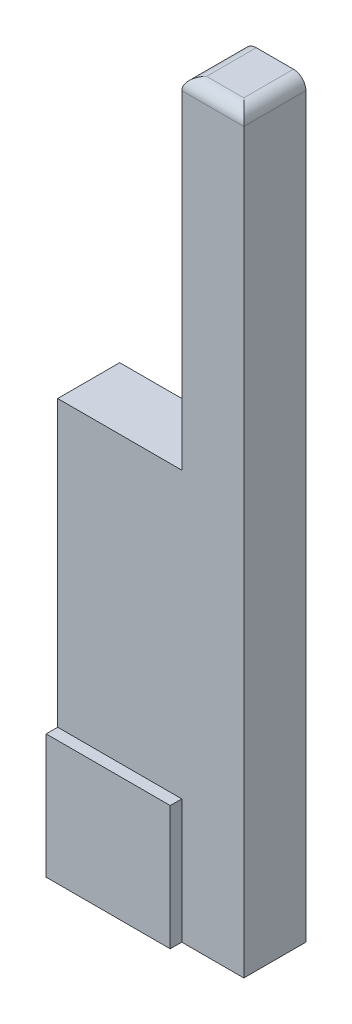
ISO-10303-21;
HEADER;
FILE_DESCRIPTION(('STEP AP214'),'2;1');
FILE_NAME('part.step','',(''),(''),'','','');
FILE_SCHEMA(('AUTOMOTIVE_DESIGN { 1 0 10303 214 1 1 1 1 }'));
ENDSEC;
DATA;
#1=APPLICATION_CONTEXT('core data for automotive mechanical design processes');
#2=APPLICATION_PROTOCOL_DEFINITION('international standard','automotive_design',2000,#1);
#3=PRODUCT_CONTEXT('',#1,'mechanical');
#4=PRODUCT('Part','Part','',(#3));
#5=PRODUCT_RELATED_PRODUCT_CATEGORY('part','',(#4));
#6=PRODUCT_DEFINITION_FORMATION('','',#4);
#7=PRODUCT_DEFINITION_CONTEXT('part definition',#1,'design');
#8=PRODUCT_DEFINITION('design','',#6,#7);
#9=PRODUCT_DEFINITION_SHAPE('','',#8);
#10=(LENGTH_UNIT() NAMED_UNIT(*) SI_UNIT(.MILLI.,.METRE.));
#11=(NAMED_UNIT(*) PLANE_ANGLE_UNIT() SI_UNIT($,.RADIAN.));
#12=(NAMED_UNIT(*) SI_UNIT($,.STERADIAN.) SOLID_ANGLE_UNIT());
#13=UNCERTAINTY_MEASURE_WITH_UNIT(LENGTH_MEASURE(1.E-05),#10,'distance_accuracy_value','');
#14=(GEOMETRIC_REPRESENTATION_CONTEXT(3) GLOBAL_UNCERTAINTY_ASSIGNED_CONTEXT((#13)) GLOBAL_UNIT_ASSIGNED_CONTEXT((#10,
#11,#12)) REPRESENTATION_CONTEXT('',''));
#15=CARTESIAN_POINT('',(0.,0.,0.));
#16=DIRECTION('',(0.,0.,1.));
#17=DIRECTION('',(1.,0.,0.));
#18=AXIS2_PLACEMENT_3D('',#15,#16,#17);
#19=CARTESIAN_POINT('',(10.,-15.48,5.));
#20=DIRECTION('',(0.,-1.,0.));
#21=DIRECTION('',(0.,0.,-1.));
#22=AXIS2_PLACEMENT_3D('',#19,#20,#21);
#23=PLANE('',#22);
#24=DIRECTION('',(-1.,0.,0.));
#25=VECTOR('',#24,1.);
#26=CARTESIAN_POINT('',(10.,-15.48,0.));
#27=LINE('',#26,#25);
#28=CARTESIAN_POINT('',(10.,-15.48,0.));
#29=VERTEX_POINT('',#28);
#30=CARTESIAN_POINT('',(0.,-15.48,0.));
#31=VERTEX_POINT('',#30);
#32=EDGE_CURVE('E159',#29,#31,#27,.T.);
#33=ORIENTED_EDGE('',*,*,#32,.T.);
#34=DIRECTION('',(0.,0.,-1.));
#35=VECTOR('',#34,1.);
#36=CARTESIAN_POINT('',(0.,-15.48,5.));
#37=LINE('',#36,#35);
#38=CARTESIAN_POINT('',(0.,-15.48,5.));
#39=VERTEX_POINT('',#38);
#40=EDGE_CURVE('E191',#39,#31,#37,.T.);
#41=ORIENTED_EDGE('',*,*,#40,.F.);
#42=DIRECTION('',(-1.,0.,0.));
#43=VECTOR('',#42,1.);
#44=CARTESIAN_POINT('',(10.,-15.48,5.));
#45=LINE('',#44,#43);
#46=CARTESIAN_POINT('',(10.,-15.48,5.));
#47=VERTEX_POINT('',#46);
#48=EDGE_CURVE('E160',#47,#39,#45,.T.);
#49=ORIENTED_EDGE('',*,*,#48,.F.);
#50=DIRECTION('',(0.,0.,-1.));
#51=VECTOR('',#50,1.);
#52=CARTESIAN_POINT('',(10.,-15.48,5.));
#53=LINE('',#52,#51);
#54=EDGE_CURVE('E172',#47,#29,#53,.T.);
#55=ORIENTED_EDGE('',*,*,#54,.T.);
#56=EDGE_LOOP('',(#33,#41,#49,#55));
#57=FACE_BOUND('',#56,.T.);
#58=ADVANCED_FACE('F32',(#57),#23,.F.);
#59=CARTESIAN_POINT('',(0.,-15.48,5.));
#60=DIRECTION('',(1.,0.,0.));
#61=DIRECTION('',(0.,1.,0.));
#62=AXIS2_PLACEMENT_3D('',#59,#60,#61);
#63=PLANE('',#62);
#64=DIRECTION('',(0.,-1.,0.));
#65=VECTOR('',#64,1.);
#66=CARTESIAN_POINT('',(0.,-15.48,0.));
#67=LINE('',#66,#65);
#68=CARTESIAN_POINT('',(0.,-48.42,0.));
#69=VERTEX_POINT('',#68);
#70=EDGE_CURVE('E175',#31,#69,#67,.T.);
#71=ORIENTED_EDGE('',*,*,#70,.T.);
#72=DIRECTION('',(0.,0.,-1.));
#73=VECTOR('',#72,1.);
#74=CARTESIAN_POINT('',(0.,-48.42,5.));
#75=LINE('',#74,#73);
#76=CARTESIAN_POINT('',(0.,-48.42,5.93));
#77=VERTEX_POINT('',#76);
#78=EDGE_CURVE('E141',#77,#69,#75,.T.);
#79=ORIENTED_EDGE('',*,*,#78,.F.);
#80=DIRECTION('',(0.,1.,0.));
#81=VECTOR('',#80,1.);
#82=CARTESIAN_POINT('',(0.,-38.42,5.93));
#83=LINE('',#82,#81);
#84=CARTESIAN_POINT('',(0.,-38.42,5.93));
#85=VERTEX_POINT('',#84);
#86=EDGE_CURVE('E134',#77,#85,#83,.T.);
#87=ORIENTED_EDGE('',*,*,#86,.T.);
#88=DIRECTION('',(0.,0.,-1.));
#89=VECTOR('',#88,1.);
#90=CARTESIAN_POINT('',(0.,-38.42,5.93));
#91=LINE('',#90,#89);
#92=CARTESIAN_POINT('',(0.,-38.42,5.));
#93=VERTEX_POINT('',#92);
#94=EDGE_CURVE('E118',#85,#93,#91,.T.);
#95=ORIENTED_EDGE('',*,*,#94,.T.);
#96=DIRECTION('',(0.,-1.,0.));
#97=VECTOR('',#96,1.);
#98=CARTESIAN_POINT('',(0.,-15.48,5.));
#99=LINE('',#98,#97);
#100=EDGE_CURVE('E163',#39,#93,#99,.T.);
#101=ORIENTED_EDGE('',*,*,#100,.F.);
#102=ORIENTED_EDGE('',*,*,#40,.T.);
#103=EDGE_LOOP('',(#71,#79,#87,#95,#101,#102));
#104=FACE_BOUND('',#103,.T.);
#105=ADVANCED_FACE('F139',(#104),#63,.F.);
#106=CARTESIAN_POINT('',(0.,-48.42,5.));
#107=DIRECTION('',(0.,1.,0.));
#108=DIRECTION('',(0.,0.,1.));
#109=AXIS2_PLACEMENT_3D('',#106,#107,#108);
#110=PLANE('',#109);
#111=CARTESIAN_POINT('',(12.5,-48.42,2.5));
#112=DIRECTION('',(0.,-1.,0.));
#113=DIRECTION('',(0.,0.,-1.));
#114=AXIS2_PLACEMENT_3D('',#111,#112,#113);
#115=CIRCLE('',#114,1.02939652566357);
#116=CARTESIAN_POINT('',(12.5,-48.42,1.47060347433643));
#117=VERTEX_POINT('',#116);
#118=EDGE_CURVE('E146',#117,#117,#115,.T.);
#119=ORIENTED_EDGE('',*,*,#118,.F.);
#120=EDGE_LOOP('',(#119));
#121=FACE_BOUND('',#120,.T.);
#122=DIRECTION('',(1.,0.,0.));
#123=VECTOR('',#122,1.);
#124=CARTESIAN_POINT('',(0.,-48.42,5.));
#125=LINE('',#124,#123);
#126=CARTESIAN_POINT('',(10.,-48.42,5.));
#127=VERTEX_POINT('',#126);
#128=CARTESIAN_POINT('',(15.,-48.42,5.));
#129=VERTEX_POINT('',#128);
#130=EDGE_CURVE('E166',#127,#129,#125,.T.);
#131=ORIENTED_EDGE('',*,*,#130,.F.);
#132=DIRECTION('',(0.,0.,-1.));
#133=VECTOR('',#132,1.);
#134=CARTESIAN_POINT('',(10.,-48.42,5.93));
#135=LINE('',#134,#133);
#136=CARTESIAN_POINT('',(10.,-48.42,5.93));
#137=VERTEX_POINT('',#136);
#138=EDGE_CURVE('E151',#137,#127,#135,.T.);
#139=ORIENTED_EDGE('',*,*,#138,.F.);
#140=DIRECTION('',(-1.,0.,0.));
#141=VECTOR('',#140,1.);
#142=CARTESIAN_POINT('',(0.,-48.42,5.93));
#143=LINE('',#142,#141);
#144=EDGE_CURVE('E127',#137,#77,#143,.T.);
#145=ORIENTED_EDGE('',*,*,#144,.T.);
#146=ORIENTED_EDGE('',*,*,#78,.T.);
#147=DIRECTION('',(1.,0.,0.));
#148=VECTOR('',#147,1.);
#149=CARTESIAN_POINT('',(0.,-48.42,0.));
#150=LINE('',#149,#148);
#151=CARTESIAN_POINT('',(15.,-48.42,0.));
#152=VERTEX_POINT('',#151);
#153=EDGE_CURVE('E177',#69,#152,#150,.T.);
#154=ORIENTED_EDGE('',*,*,#153,.T.);
#155=DIRECTION('',(0.,0.,-1.));
#156=VECTOR('',#155,1.);
#157=CARTESIAN_POINT('',(15.,-48.42,5.));
#158=LINE('',#157,#156);
#159=EDGE_CURVE('E187',#129,#152,#158,.T.);
#160=ORIENTED_EDGE('',*,*,#159,.F.);
#161=EDGE_LOOP('',(#131,#139,#145,#146,#154,#160));
#162=FACE_BOUND('',#161,.T.);
#163=ADVANCED_FACE('F220',(#121,#162),#110,.F.);
#164=CARTESIAN_POINT('',(15.,-48.42,5.));
#165=DIRECTION('',(-1.,0.,0.));
#166=DIRECTION('',(0.,-1.,0.));
#167=AXIS2_PLACEMENT_3D('',#164,#165,#166);
#168=PLANE('',#167);
#169=DIRECTION('',(0.,1.,0.));
#170=VECTOR('',#169,1.);
#171=CARTESIAN_POINT('',(15.,-48.42,0.));
#172=LINE('',#171,#170);
#173=CARTESIAN_POINT('',(15.,11.,0.));
#174=VERTEX_POINT('',#173);
#175=EDGE_CURVE('E179',#152,#174,#172,.T.);
#176=ORIENTED_EDGE('',*,*,#175,.T.);
#177=DIRECTION('',(0.,0.,-1.));
#178=VECTOR('',#177,1.);
#179=CARTESIAN_POINT('',(15.,11.,5.));
#180=LINE('',#179,#178);
#181=CARTESIAN_POINT('',(15.,11.,5.));
#182=VERTEX_POINT('',#181);
#183=EDGE_CURVE('E41',#174,#182,#180,.F.);
#184=ORIENTED_EDGE('',*,*,#183,.T.);
#185=DIRECTION('',(0.,1.,0.));
#186=VECTOR('',#185,1.);
#187=CARTESIAN_POINT('',(15.,-48.42,5.));
#188=LINE('',#187,#186);
#189=EDGE_CURVE('E168',#129,#182,#188,.T.);
#190=ORIENTED_EDGE('',*,*,#189,.F.);
#191=ORIENTED_EDGE('',*,*,#159,.T.);
#192=EDGE_LOOP('',(#176,#184,#190,#191));
#193=FACE_BOUND('',#192,.T.);
#194=ADVANCED_FACE('F223',(#193),#168,.F.);
#195=CARTESIAN_POINT('',(15.,12.,5.));
#196=DIRECTION('',(0.,-1.,0.));
#197=DIRECTION('',(0.,0.,-1.));
#198=AXIS2_PLACEMENT_3D('',#195,#196,#197);
#199=PLANE('',#198);
#200=DIRECTION('',(-1.,0.,0.));
#201=VECTOR('',#200,1.);
#202=CARTESIAN_POINT('',(15.,12.,0.));
#203=LINE('',#202,#201);
#204=CARTESIAN_POINT('',(14.,12.,0.));
#205=VERTEX_POINT('',#204);
#206=CARTESIAN_POINT('',(11.,12.,0.));
#207=VERTEX_POINT('',#206);
#208=EDGE_CURVE('E181',#205,#207,#203,.T.);
#209=ORIENTED_EDGE('',*,*,#208,.T.);
#210=DIRECTION('',(0.,0.,-1.));
#211=VECTOR('',#210,1.);
#212=CARTESIAN_POINT('',(11.,12.,5.));
#213=LINE('',#212,#211);
#214=CARTESIAN_POINT('',(11.,12.,4.));
#215=VERTEX_POINT('',#214);
#216=EDGE_CURVE('E204',#207,#215,#213,.F.);
#217=ORIENTED_EDGE('',*,*,#216,.T.);
#218=DIRECTION('',(-1.,0.,0.));
#219=VECTOR('',#218,1.);
#220=CARTESIAN_POINT('',(15.,12.,4.));
#221=LINE('',#220,#219);
#222=CARTESIAN_POINT('',(14.,12.,4.));
#223=VERTEX_POINT('',#222);
#224=EDGE_CURVE('E56',#215,#223,#221,.F.);
#225=ORIENTED_EDGE('',*,*,#224,.T.);
#226=DIRECTION('',(0.,0.,-1.));
#227=VECTOR('',#226,1.);
#228=CARTESIAN_POINT('',(14.,12.,5.));
#229=LINE('',#228,#227);
#230=EDGE_CURVE('E202',#223,#205,#229,.T.);
#231=ORIENTED_EDGE('',*,*,#230,.T.);
#232=EDGE_LOOP('',(#209,#217,#225,#231));
#233=FACE_BOUND('',#232,.T.);
#234=ADVANCED_FACE('F251',(#233),#199,.F.);
#235=CARTESIAN_POINT('',(10.,12.,5.));
#236=DIRECTION('',(1.,0.,0.));
#237=DIRECTION('',(0.,1.,0.));
#238=AXIS2_PLACEMENT_3D('',#235,#236,#237);
#239=PLANE('',#238);
#240=DIRECTION('',(0.,-1.,0.));
#241=VECTOR('',#240,1.);
#242=CARTESIAN_POINT('',(10.,12.,5.));
#243=LINE('',#242,#241);
#244=CARTESIAN_POINT('',(10.,11.,5.));
#245=VERTEX_POINT('',#244);
#246=EDGE_CURVE('E170',#245,#47,#243,.T.);
#247=ORIENTED_EDGE('',*,*,#246,.F.);
#248=DIRECTION('',(0.,0.,-1.));
#249=VECTOR('',#248,1.);
#250=CARTESIAN_POINT('',(10.,11.,5.));
#251=LINE('',#250,#249);
#252=CARTESIAN_POINT('',(10.,11.,0.));
#253=VERTEX_POINT('',#252);
#254=EDGE_CURVE('E194',#245,#253,#251,.T.);
#255=ORIENTED_EDGE('',*,*,#254,.T.);
#256=DIRECTION('',(0.,-1.,0.));
#257=VECTOR('',#256,1.);
#258=CARTESIAN_POINT('',(10.,12.,0.));
#259=LINE('',#258,#257);
#260=EDGE_CURVE('E164',#253,#29,#259,.T.);
#261=ORIENTED_EDGE('',*,*,#260,.T.);
#262=ORIENTED_EDGE('',*,*,#54,.F.);
#263=EDGE_LOOP('',(#247,#255,#261,#262));
#264=FACE_BOUND('',#263,.T.);
#265=ADVANCED_FACE('F247',(#264),#239,.F.);
#266=CARTESIAN_POINT('',(0.,0.,5.));
#267=DIRECTION('',(0.,0.,1.));
#268=DIRECTION('',(1.,0.,0.));
#269=AXIS2_PLACEMENT_3D('',#266,#267,#268);
#270=PLANE('',#269);
#271=ORIENTED_EDGE('',*,*,#189,.T.);
#272=DIRECTION('',(-1.,0.,0.));
#273=VECTOR('',#272,1.);
#274=CARTESIAN_POINT('',(10.,11.,5.));
#275=LINE('',#274,#273);
#276=EDGE_CURVE('E11',#182,#245,#275,.T.);
#277=ORIENTED_EDGE('',*,*,#276,.T.);
#278=ORIENTED_EDGE('',*,*,#246,.T.);
#279=ORIENTED_EDGE('',*,*,#48,.T.);
#280=ORIENTED_EDGE('',*,*,#100,.T.);
#281=DIRECTION('',(-1.,0.,0.));
#282=VECTOR('',#281,1.);
#283=CARTESIAN_POINT('',(0.,-38.42,5.));
#284=LINE('',#283,#282);
#285=CARTESIAN_POINT('',(10.,-38.42,5.));
#286=VERTEX_POINT('',#285);
#287=EDGE_CURVE('E123',#286,#93,#284,.T.);
#288=ORIENTED_EDGE('',*,*,#287,.F.);
#289=DIRECTION('',(0.,1.,0.));
#290=VECTOR('',#289,1.);
#291=CARTESIAN_POINT('',(10.,0.,5.));
#292=LINE('',#291,#290);
#293=EDGE_CURVE('E156',#127,#286,#292,.T.);
#294=ORIENTED_EDGE('',*,*,#293,.F.);
#295=ORIENTED_EDGE('',*,*,#130,.T.);
#296=EDGE_LOOP('',(#271,#277,#278,#279,#280,#288,#294,#295));
#297=FACE_BOUND('',#296,.T.);
#298=ADVANCED_FACE('F244',(#297),#270,.T.);
#299=CARTESIAN_POINT('',(0.,0.,0.));
#300=DIRECTION('',(0.,0.,1.));
#301=DIRECTION('',(1.,0.,0.));
#302=AXIS2_PLACEMENT_3D('',#299,#300,#301);
#303=PLANE('',#302);
#304=ORIENTED_EDGE('',*,*,#260,.F.);
#305=CARTESIAN_POINT('',(11.,11.,0.));
#306=DIRECTION('',(0.,0.,1.));
#307=DIRECTION('',(1.,0.,0.));
#308=AXIS2_PLACEMENT_3D('',#305,#306,#307);
#309=CIRCLE('',#308,1.);
#310=EDGE_CURVE('E199',#253,#207,#309,.F.);
#311=ORIENTED_EDGE('',*,*,#310,.T.);
#312=ORIENTED_EDGE('',*,*,#208,.F.);
#313=CARTESIAN_POINT('',(14.,11.,0.));
#314=DIRECTION('',(0.,0.,1.));
#315=DIRECTION('',(1.,0.,0.));
#316=AXIS2_PLACEMENT_3D('',#313,#314,#315);
#317=CIRCLE('',#316,1.);
#318=EDGE_CURVE('E197',#205,#174,#317,.F.);
#319=ORIENTED_EDGE('',*,*,#318,.T.);
#320=ORIENTED_EDGE('',*,*,#175,.F.);
#321=ORIENTED_EDGE('',*,*,#153,.F.);
#322=ORIENTED_EDGE('',*,*,#70,.F.);
#323=ORIENTED_EDGE('',*,*,#32,.F.);
#324=EDGE_LOOP('',(#304,#311,#312,#319,#320,#321,#322,#323));
#325=FACE_BOUND('',#324,.T.);
#326=ADVANCED_FACE('F234',(#325),#303,.F.);
#327=CARTESIAN_POINT('',(10.,-38.42,5.93));
#328=DIRECTION('',(1.,0.,0.));
#329=DIRECTION('',(0.,1.,0.));
#330=AXIS2_PLACEMENT_3D('',#327,#328,#329);
#331=PLANE('',#330);
#332=ORIENTED_EDGE('',*,*,#138,.T.);
#333=ORIENTED_EDGE('',*,*,#293,.T.);
#334=DIRECTION('',(0.,0.,-1.));
#335=VECTOR('',#334,1.);
#336=CARTESIAN_POINT('',(10.,-38.42,5.93));
#337=LINE('',#336,#335);
#338=CARTESIAN_POINT('',(10.,-38.42,5.93));
#339=VERTEX_POINT('',#338);
#340=EDGE_CURVE('E126',#339,#286,#337,.T.);
#341=ORIENTED_EDGE('',*,*,#340,.F.);
#342=DIRECTION('',(0.,-1.,0.));
#343=VECTOR('',#342,1.);
#344=CARTESIAN_POINT('',(10.,-38.42,5.93));
#345=LINE('',#344,#343);
#346=EDGE_CURVE('E137',#339,#137,#345,.T.);
#347=ORIENTED_EDGE('',*,*,#346,.T.);
#348=EDGE_LOOP('',(#332,#333,#341,#347));
#349=FACE_BOUND('',#348,.T.);
#350=ADVANCED_FACE('F229',(#349),#331,.T.);
#351=CARTESIAN_POINT('',(0.,-38.42,5.93));
#352=DIRECTION('',(0.,1.,0.));
#353=DIRECTION('',(0.,0.,1.));
#354=AXIS2_PLACEMENT_3D('',#351,#352,#353);
#355=PLANE('',#354);
#356=ORIENTED_EDGE('',*,*,#340,.T.);
#357=ORIENTED_EDGE('',*,*,#287,.T.);
#358=ORIENTED_EDGE('',*,*,#94,.F.);
#359=DIRECTION('',(1.,0.,0.));
#360=VECTOR('',#359,1.);
#361=CARTESIAN_POINT('',(0.,-38.42,5.93));
#362=LINE('',#361,#360);
#363=EDGE_CURVE('E122',#85,#339,#362,.T.);
#364=ORIENTED_EDGE('',*,*,#363,.T.);
#365=EDGE_LOOP('',(#356,#357,#358,#364));
#366=FACE_BOUND('',#365,.T.);
#367=ADVANCED_FACE('F121',(#366),#355,.T.);
#368=CARTESIAN_POINT('',(0.,0.,5.93));
#369=DIRECTION('',(0.,0.,1.));
#370=DIRECTION('',(1.,0.,0.));
#371=AXIS2_PLACEMENT_3D('',#368,#369,#370);
#372=PLANE('',#371);
#373=ORIENTED_EDGE('',*,*,#86,.F.);
#374=ORIENTED_EDGE('',*,*,#144,.F.);
#375=ORIENTED_EDGE('',*,*,#346,.F.);
#376=ORIENTED_EDGE('',*,*,#363,.F.);
#377=EDGE_LOOP('',(#373,#374,#375,#376));
#378=FACE_BOUND('',#377,.T.);
#379=ADVANCED_FACE('F132',(#378),#372,.T.);
#380=CARTESIAN_POINT('',(14.,11.,5.));
#381=DIRECTION('',(0.,0.,-1.));
#382=DIRECTION('',(-1.,0.,0.));
#383=AXIS2_PLACEMENT_3D('',#380,#381,#382);
#384=CYLINDRICAL_SURFACE('',#383,1.);
#385=ORIENTED_EDGE('',*,*,#318,.F.);
#386=ORIENTED_EDGE('',*,*,#230,.F.);
#387=CARTESIAN_POINT('',(14.,11.,4.));
#388=DIRECTION('',(0.707106781186547,0.,-0.707106781186547));
#389=DIRECTION('',(0.707106781186547,0.,0.707106781186547));
#390=AXIS2_PLACEMENT_3D('',#387,#388,#389);
#391=ELLIPSE('',#390,1.41421356237309,1.);
#392=EDGE_CURVE('E36',#182,#223,#391,.F.);
#393=ORIENTED_EDGE('',*,*,#392,.F.);
#394=ORIENTED_EDGE('',*,*,#183,.F.);
#395=EDGE_LOOP('',(#385,#386,#393,#394));
#396=FACE_BOUND('',#395,.T.);
#397=ADVANCED_FACE('F34',(#396),#384,.T.);
#398=CARTESIAN_POINT('',(0.,11.,4.));
#399=DIRECTION('',(1.,0.,0.));
#400=DIRECTION('',(0.,0.,-1.));
#401=AXIS2_PLACEMENT_3D('',#398,#399,#400);
#402=CYLINDRICAL_SURFACE('',#401,1.);
#403=ORIENTED_EDGE('',*,*,#392,.T.);
#404=ORIENTED_EDGE('',*,*,#224,.F.);
#405=CARTESIAN_POINT('',(11.,11.,4.));
#406=DIRECTION('',(0.707106781186547,0.,0.707106781186547));
#407=DIRECTION('',(0.707106781186547,0.,-0.707106781186547));
#408=AXIS2_PLACEMENT_3D('',#405,#406,#407);
#409=ELLIPSE('',#408,1.41421356237309,1.);
#410=EDGE_CURVE('E144',#245,#215,#409,.F.);
#411=ORIENTED_EDGE('',*,*,#410,.F.);
#412=ORIENTED_EDGE('',*,*,#276,.F.);
#413=EDGE_LOOP('',(#403,#404,#411,#412));
#414=FACE_BOUND('',#413,.T.);
#415=ADVANCED_FACE('F242',(#414),#402,.T.);
#416=CARTESIAN_POINT('',(11.,11.,5.));
#417=DIRECTION('',(0.,0.,-1.));
#418=DIRECTION('',(-1.,0.,0.));
#419=AXIS2_PLACEMENT_3D('',#416,#417,#418);
#420=CYLINDRICAL_SURFACE('',#419,1.);
#421=ORIENTED_EDGE('',*,*,#410,.T.);
#422=ORIENTED_EDGE('',*,*,#216,.F.);
#423=ORIENTED_EDGE('',*,*,#310,.F.);
#424=ORIENTED_EDGE('',*,*,#254,.F.);
#425=EDGE_LOOP('',(#421,#422,#423,#424));
#426=FACE_BOUND('',#425,.T.);
#427=ADVANCED_FACE('F252',(#426),#420,.T.);
#428=CARTESIAN_POINT('',(12.5,-47.92,2.5));
#429=DIRECTION('',(0.,-1.,0.));
#430=DIRECTION('',(0.,0.,-1.));
#431=AXIS2_PLACEMENT_3D('',#428,#429,#430);
#432=CYLINDRICAL_SURFACE('',#431,1.02939652566357);
#433=CARTESIAN_POINT('',(12.5,-47.92,2.5));
#434=DIRECTION('',(0.,-1.,0.));
#435=DIRECTION('',(0.,0.,-1.));
#436=AXIS2_PLACEMENT_3D('',#433,#434,#435);
#437=CIRCLE('',#436,1.02939652566357);
#438=CARTESIAN_POINT('',(12.5,-47.92,1.47060347433643));
#439=VERTEX_POINT('',#438);
#440=EDGE_CURVE('E207',#439,#439,#437,.T.);
#441=ORIENTED_EDGE('',*,*,#440,.F.);
#442=EDGE_LOOP('',(#441));
#443=FACE_BOUND('',#442,.T.);
#444=ORIENTED_EDGE('',*,*,#118,.T.);
#445=EDGE_LOOP('',(#444));
#446=FACE_BOUND('',#445,.T.);
#447=ADVANCED_FACE('F218',(#443,#446),#432,.F.);
#448=CARTESIAN_POINT('',(12.5,-47.92,2.5));
#449=DIRECTION('',(0.,-1.,0.));
#450=DIRECTION('',(0.,0.,-1.));
#451=AXIS2_PLACEMENT_3D('',#448,#449,#450);
#452=PLANE('',#451);
#453=ORIENTED_EDGE('',*,*,#440,.T.);
#454=EDGE_LOOP('',(#453));
#455=FACE_BOUND('',#454,.T.);
#456=ADVANCED_FACE('F259',(#455),#452,.T.);
#457=CLOSED_SHELL('',(#58,#105,#163,#194,#234,#265,#298,#326,#350,#367,#379,#397,#415,#427,#447,#456));
#458=MANIFOLD_SOLID_BREP('B2',#457);
#459=ADVANCED_BREP_SHAPE_REPRESENTATION('',(#18,#458),#14);
#460=SHAPE_DEFINITION_REPRESENTATION(#9,#459);
ENDSEC;
END-ISO-10303-21;
